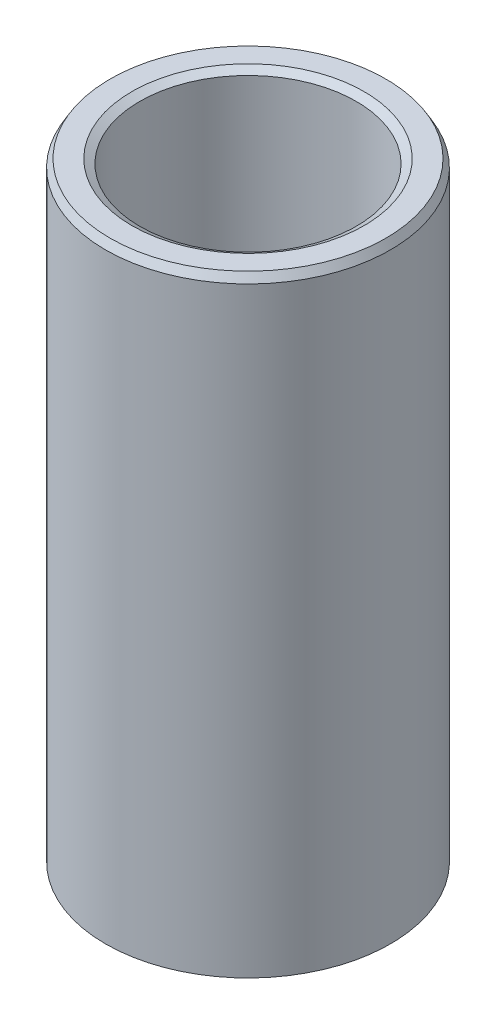
ISO-10303-21;
HEADER;
FILE_DESCRIPTION(('STEP AP214'),'2;1');
FILE_NAME('part.step','',(''),(''),'','','');
FILE_SCHEMA(('AUTOMOTIVE_DESIGN { 1 0 10303 214 1 1 1 1 }'));
ENDSEC;
DATA;
#1=APPLICATION_CONTEXT('core data for automotive mechanical design processes');
#2=APPLICATION_PROTOCOL_DEFINITION('international standard','automotive_design',2000,#1);
#3=PRODUCT_CONTEXT('',#1,'mechanical');
#4=PRODUCT('Part','Part','',(#3));
#5=PRODUCT_RELATED_PRODUCT_CATEGORY('part','',(#4));
#6=PRODUCT_DEFINITION_FORMATION('','',#4);
#7=PRODUCT_DEFINITION_CONTEXT('part definition',#1,'design');
#8=PRODUCT_DEFINITION('design','',#6,#7);
#9=PRODUCT_DEFINITION_SHAPE('','',#8);
#10=(LENGTH_UNIT() NAMED_UNIT(*) SI_UNIT(.MILLI.,.METRE.));
#11=(NAMED_UNIT(*) PLANE_ANGLE_UNIT() SI_UNIT($,.RADIAN.));
#12=(NAMED_UNIT(*) SI_UNIT($,.STERADIAN.) SOLID_ANGLE_UNIT());
#13=UNCERTAINTY_MEASURE_WITH_UNIT(LENGTH_MEASURE(1.E-05),#10,'distance_accuracy_value','');
#14=(GEOMETRIC_REPRESENTATION_CONTEXT(3) GLOBAL_UNCERTAINTY_ASSIGNED_CONTEXT((#13)) GLOBAL_UNIT_ASSIGNED_CONTEXT((#10,
#11,#12)) REPRESENTATION_CONTEXT('',''));
#15=CARTESIAN_POINT('',(0.,0.,0.));
#16=DIRECTION('',(0.,0.,1.));
#17=DIRECTION('',(1.,0.,0.));
#18=AXIS2_PLACEMENT_3D('',#15,#16,#17);
#19=CARTESIAN_POINT('',(0.,183.027756728281,0.));
#20=DIRECTION('',(0.,-1.,0.));
#21=DIRECTION('',(0.,0.,-1.));
#22=AXIS2_PLACEMENT_3D('',#19,#20,#21);
#23=CYLINDRICAL_SURFACE('',#22,42.5);
#24=CARTESIAN_POINT('',(0.,1.35623324528886,0.));
#25=DIRECTION('',(0.,1.,0.));
#26=DIRECTION('',(0.,0.,1.));
#27=AXIS2_PLACEMENT_3D('',#24,#25,#26);
#28=CIRCLE('',#27,42.5);
#29=CARTESIAN_POINT('',(0.,1.35623324528886,42.5));
#30=VERTEX_POINT('',#29);
#31=EDGE_CURVE('E10',#30,#30,#28,.T.);
#32=ORIENTED_EDGE('',*,*,#31,.T.);
#33=EDGE_LOOP('',(#32));
#34=FACE_BOUND('',#33,.T.);
#35=CARTESIAN_POINT('',(0.,180.678691840527,0.));
#36=DIRECTION('',(0.,1.,0.));
#37=DIRECTION('',(0.,0.,1.));
#38=AXIS2_PLACEMENT_3D('',#35,#36,#37);
#39=CIRCLE('',#38,42.5);
#40=CARTESIAN_POINT('',(0.,180.678691840527,42.5));
#41=VERTEX_POINT('',#40);
#42=EDGE_CURVE('E50',#41,#41,#39,.F.);
#43=ORIENTED_EDGE('',*,*,#42,.T.);
#44=EDGE_LOOP('',(#43));
#45=FACE_BOUND('',#44,.T.);
#46=ADVANCED_FACE('F39',(#34,#45),#23,.T.);
#47=CARTESIAN_POINT('',(0.,183.027756728281,0.));
#48=DIRECTION('',(0.,1.,0.));
#49=DIRECTION('',(0.,0.,1.));
#50=AXIS2_PLACEMENT_3D('',#47,#48,#49);
#51=PLANE('',#50);
#52=CARTESIAN_POINT('',(0.,183.027756728281,0.));
#53=DIRECTION('',(0.,1.,0.));
#54=DIRECTION('',(0.,0.,1.));
#55=AXIS2_PLACEMENT_3D('',#52,#53,#54);
#56=CIRCLE('',#55,34.6491987584472);
#57=CARTESIAN_POINT('',(0.,183.027756728281,34.6491987584472));
#58=VERTEX_POINT('',#57);
#59=EDGE_CURVE('E58',#58,#58,#56,.F.);
#60=ORIENTED_EDGE('',*,*,#59,.T.);
#61=EDGE_LOOP('',(#60));
#62=FACE_BOUND('',#61,.T.);
#63=CARTESIAN_POINT('',(0.,183.027756728281,0.));
#64=DIRECTION('',(0.,1.,0.));
#65=DIRECTION('',(0.,0.,1.));
#66=AXIS2_PLACEMENT_3D('',#63,#64,#65);
#67=CIRCLE('',#66,41.1437667547111);
#68=CARTESIAN_POINT('',(0.,183.027756728281,41.1437667547111));
#69=VERTEX_POINT('',#68);
#70=EDGE_CURVE('E61',#69,#69,#67,.T.);
#71=ORIENTED_EDGE('',*,*,#70,.T.);
#72=EDGE_LOOP('',(#71));
#73=FACE_BOUND('',#72,.T.);
#74=ADVANCED_FACE('F88',(#62,#73),#51,.T.);
#75=CARTESIAN_POINT('',(0.,0.,0.));
#76=DIRECTION('',(0.,1.,0.));
#77=DIRECTION('',(0.,0.,1.));
#78=AXIS2_PLACEMENT_3D('',#75,#76,#77);
#79=PLANE('',#78);
#80=CARTESIAN_POINT('',(0.,0.,0.));
#81=DIRECTION('',(0.,1.,0.));
#82=DIRECTION('',(0.,0.,1.));
#83=AXIS2_PLACEMENT_3D('',#80,#81,#82);
#84=CIRCLE('',#83,33.6563671159818);
#85=CARTESIAN_POINT('',(0.,0.,33.6563671159818));
#86=VERTEX_POINT('',#85);
#87=EDGE_CURVE('E51',#86,#86,#84,.T.);
#88=ORIENTED_EDGE('',*,*,#87,.T.);
#89=EDGE_LOOP('',(#88));
#90=FACE_BOUND('',#89,.T.);
#91=CARTESIAN_POINT('',(0.,0.,0.));
#92=DIRECTION('',(0.,1.,0.));
#93=DIRECTION('',(0.,0.,1.));
#94=AXIS2_PLACEMENT_3D('',#91,#92,#93);
#95=CIRCLE('',#94,40.1509351122456);
#96=CARTESIAN_POINT('',(0.,0.,40.1509351122456));
#97=VERTEX_POINT('',#96);
#98=EDGE_CURVE('E54',#97,#97,#95,.F.);
#99=ORIENTED_EDGE('',*,*,#98,.T.);
#100=EDGE_LOOP('',(#99));
#101=FACE_BOUND('',#100,.T.);
#102=ADVANCED_FACE('F83',(#90,#101),#79,.F.);
#103=CARTESIAN_POINT('',(0.,183.027756728281,0.));
#104=DIRECTION('',(0.,-1.,0.));
#105=DIRECTION('',(0.,0.,-1.));
#106=AXIS2_PLACEMENT_3D('',#103,#104,#105);
#107=CYLINDRICAL_SURFACE('',#106,32.3001338706929);
#108=CARTESIAN_POINT('',(0.,181.671523482993,0.));
#109=DIRECTION('',(0.,1.,0.));
#110=DIRECTION('',(0.,0.,1.));
#111=AXIS2_PLACEMENT_3D('',#108,#109,#110);
#112=CIRCLE('',#111,32.3001338706929);
#113=CARTESIAN_POINT('',(0.,181.671523482993,32.3001338706929));
#114=VERTEX_POINT('',#113);
#115=EDGE_CURVE('E67',#114,#114,#112,.T.);
#116=ORIENTED_EDGE('',*,*,#115,.T.);
#117=EDGE_LOOP('',(#116));
#118=FACE_BOUND('',#117,.T.);
#119=CARTESIAN_POINT('',(0.,2.34906488775438,0.));
#120=DIRECTION('',(0.,1.,0.));
#121=DIRECTION('',(0.,0.,1.));
#122=AXIS2_PLACEMENT_3D('',#119,#120,#121);
#123=CIRCLE('',#122,32.3001338706929);
#124=CARTESIAN_POINT('',(0.,2.34906488775438,32.3001338706929));
#125=VERTEX_POINT('',#124);
#126=EDGE_CURVE('E69',#125,#125,#123,.F.);
#127=ORIENTED_EDGE('',*,*,#126,.T.);
#128=EDGE_LOOP('',(#127));
#129=FACE_BOUND('',#128,.T.);
#130=ADVANCED_FACE('F71',(#118,#129),#107,.F.);
#131=CARTESIAN_POINT('',(0.,181.671523482993,0.));
#132=DIRECTION('',(0.,1.,0.));
#133=DIRECTION('',(0.,0.,1.));
#134=AXIS2_PLACEMENT_3D('',#131,#132,#133);
#135=CONICAL_SURFACE('',#134,32.3001338706929,1.0471975511966);
#136=ORIENTED_EDGE('',*,*,#59,.F.);
#137=EDGE_LOOP('',(#136));
#138=FACE_BOUND('',#137,.T.);
#139=ORIENTED_EDGE('',*,*,#115,.F.);
#140=EDGE_LOOP('',(#139));
#141=FACE_BOUND('',#140,.T.);
#142=ADVANCED_FACE('F77',(#138,#141),#135,.F.);
#143=CARTESIAN_POINT('',(0.,0.,0.));
#144=DIRECTION('',(0.,-1.,0.));
#145=DIRECTION('',(0.,0.,-1.));
#146=AXIS2_PLACEMENT_3D('',#143,#144,#145);
#147=CONICAL_SURFACE('',#146,33.6563671159818,0.52359877559829);
#148=ORIENTED_EDGE('',*,*,#126,.F.);
#149=EDGE_LOOP('',(#148));
#150=FACE_BOUND('',#149,.T.);
#151=ORIENTED_EDGE('',*,*,#87,.F.);
#152=EDGE_LOOP('',(#151));
#153=FACE_BOUND('',#152,.T.);
#154=ADVANCED_FACE('F73',(#150,#153),#147,.F.);
#155=CARTESIAN_POINT('',(0.,1.35623324528886,0.));
#156=DIRECTION('',(0.,1.,0.));
#157=DIRECTION('',(0.,0.,1.));
#158=AXIS2_PLACEMENT_3D('',#155,#156,#157);
#159=CONICAL_SURFACE('',#158,42.5,1.04719755119661);
#160=ORIENTED_EDGE('',*,*,#98,.F.);
#161=EDGE_LOOP('',(#160));
#162=FACE_BOUND('',#161,.T.);
#163=ORIENTED_EDGE('',*,*,#31,.F.);
#164=EDGE_LOOP('',(#163));
#165=FACE_BOUND('',#164,.T.);
#166=ADVANCED_FACE('F76',(#162,#165),#159,.T.);
#167=CARTESIAN_POINT('',(0.,183.027756728281,0.));
#168=DIRECTION('',(0.,-1.,0.));
#169=DIRECTION('',(0.,0.,-1.));
#170=AXIS2_PLACEMENT_3D('',#167,#168,#169);
#171=CONICAL_SURFACE('',#170,41.1437667547111,0.523598775598297);
#172=ORIENTED_EDGE('',*,*,#42,.F.);
#173=EDGE_LOOP('',(#172));
#174=FACE_BOUND('',#173,.T.);
#175=ORIENTED_EDGE('',*,*,#70,.F.);
#176=EDGE_LOOP('',(#175));
#177=FACE_BOUND('',#176,.T.);
#178=ADVANCED_FACE('F45',(#174,#177),#171,.T.);
#179=CLOSED_SHELL('',(#46,#74,#102,#130,#142,#154,#166,#178));
#180=MANIFOLD_SOLID_BREP('B2',#179);
#181=ADVANCED_BREP_SHAPE_REPRESENTATION('',(#18,#180),#14);
#182=SHAPE_DEFINITION_REPRESENTATION(#9,#181);
ENDSEC;
END-ISO-10303-21;
